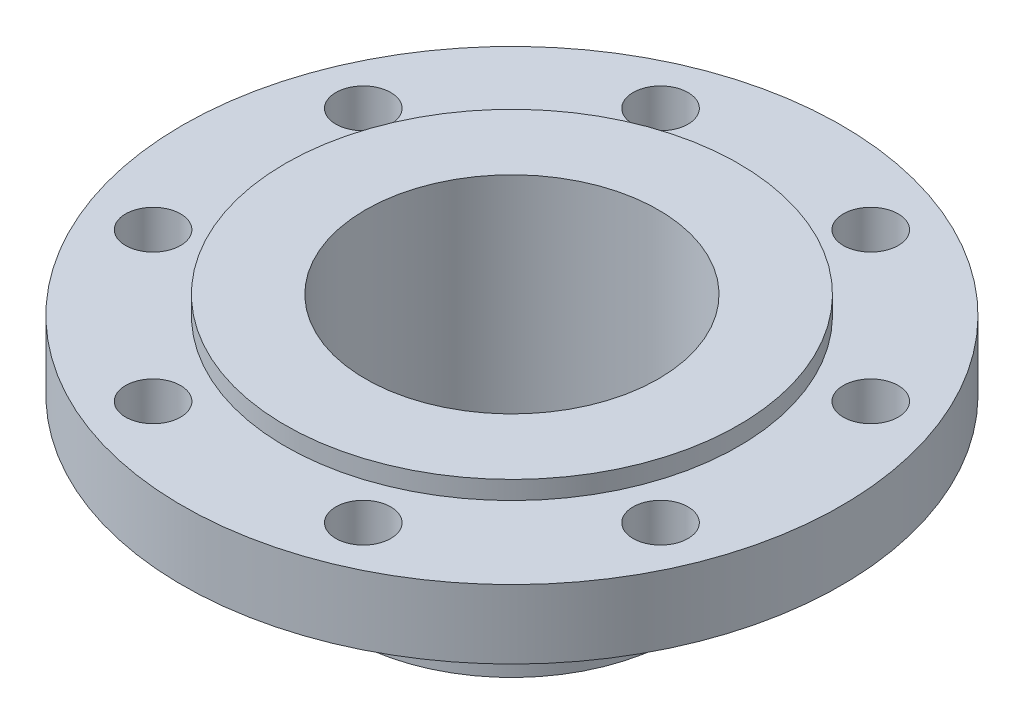
ISO-10303-21;
HEADER;
FILE_DESCRIPTION(('STEP AP214'),'2;1');
FILE_NAME('part.step','',(''),(''),'','','');
FILE_SCHEMA(('AUTOMOTIVE_DESIGN { 1 0 10303 214 1 1 1 1 }'));
ENDSEC;
DATA;
#1=APPLICATION_CONTEXT('core data for automotive mechanical design processes');
#2=APPLICATION_PROTOCOL_DEFINITION('international standard','automotive_design',2000,#1);
#3=PRODUCT_CONTEXT('',#1,'mechanical');
#4=PRODUCT('Part','Part','',(#3));
#5=PRODUCT_RELATED_PRODUCT_CATEGORY('part','',(#4));
#6=PRODUCT_DEFINITION_FORMATION('','',#4);
#7=PRODUCT_DEFINITION_CONTEXT('part definition',#1,'design');
#8=PRODUCT_DEFINITION('design','',#6,#7);
#9=PRODUCT_DEFINITION_SHAPE('','',#8);
#10=(LENGTH_UNIT() NAMED_UNIT(*) SI_UNIT(.MILLI.,.METRE.));
#11=(NAMED_UNIT(*) PLANE_ANGLE_UNIT() SI_UNIT($,.RADIAN.));
#12=(NAMED_UNIT(*) SI_UNIT($,.STERADIAN.) SOLID_ANGLE_UNIT());
#13=UNCERTAINTY_MEASURE_WITH_UNIT(LENGTH_MEASURE(1.E-05),#10,'distance_accuracy_value','');
#14=(GEOMETRIC_REPRESENTATION_CONTEXT(3) GLOBAL_UNCERTAINTY_ASSIGNED_CONTEXT((#13)) GLOBAL_UNIT_ASSIGNED_CONTEXT((#10,
#11,#12)) REPRESENTATION_CONTEXT('',''));
#15=CARTESIAN_POINT('',(0.,0.,0.));
#16=DIRECTION('',(0.,0.,1.));
#17=DIRECTION('',(1.,0.,0.));
#18=AXIS2_PLACEMENT_3D('',#15,#16,#17);
#19=CARTESIAN_POINT('',(0.,0.,0.));
#20=DIRECTION('',(0.,1.,0.));
#21=DIRECTION('',(-1.,0.,0.));
#22=AXIS2_PLACEMENT_3D('',#19,#20,#21);
#23=PLANE('',#22);
#24=CARTESIAN_POINT('',(0.,0.,0.));
#25=DIRECTION('',(0.,1.,0.));
#26=DIRECTION('',(-1.,0.,0.));
#27=AXIS2_PLACEMENT_3D('',#24,#25,#26);
#28=CIRCLE('',#27,50.8);
#29=CARTESIAN_POINT('',(-50.8,0.,0.));
#30=VERTEX_POINT('',#29);
#31=EDGE_CURVE('E49',#30,#30,#28,.T.);
#32=ORIENTED_EDGE('',*,*,#31,.F.);
#33=EDGE_LOOP('',(#32));
#34=FACE_BOUND('',#33,.T.);
#35=CARTESIAN_POINT('',(0.,0.,0.));
#36=DIRECTION('',(0.,1.,0.));
#37=DIRECTION('',(-1.,0.,0.));
#38=AXIS2_PLACEMENT_3D('',#35,#36,#37);
#39=CIRCLE('',#38,78.613);
#40=CARTESIAN_POINT('',(-78.613,0.,0.));
#41=VERTEX_POINT('',#40);
#42=EDGE_CURVE('E10',#41,#41,#39,.T.);
#43=ORIENTED_EDGE('',*,*,#42,.T.);
#44=EDGE_LOOP('',(#43));
#45=FACE_BOUND('',#44,.T.);
#46=ADVANCED_FACE('F30',(#34,#45),#23,.T.);
#47=CARTESIAN_POINT('',(0.,0.,0.));
#48=DIRECTION('',(0.,1.,0.));
#49=DIRECTION('',(-1.,0.,0.));
#50=AXIS2_PLACEMENT_3D('',#47,#48,#49);
#51=CYLINDRICAL_SURFACE('',#50,78.613);
#52=CARTESIAN_POINT('',(0.,-6.35,0.));
#53=DIRECTION('',(0.,1.,0.));
#54=DIRECTION('',(-1.,0.,0.));
#55=AXIS2_PLACEMENT_3D('',#52,#53,#54);
#56=CIRCLE('',#55,78.613);
#57=CARTESIAN_POINT('',(-78.613,-6.35000000000001,0.));
#58=VERTEX_POINT('',#57);
#59=EDGE_CURVE('E37',#58,#58,#56,.T.);
#60=ORIENTED_EDGE('',*,*,#59,.T.);
#61=EDGE_LOOP('',(#60));
#62=FACE_BOUND('',#61,.T.);
#63=ORIENTED_EDGE('',*,*,#42,.F.);
#64=EDGE_LOOP('',(#63));
#65=FACE_BOUND('',#64,.T.);
#66=ADVANCED_FACE('F114',(#62,#65),#51,.T.);
#67=CARTESIAN_POINT('',(-78.613,-6.35000000000001,0.));
#68=DIRECTION('',(0.,1.,0.));
#69=DIRECTION('',(-1.,0.,0.));
#70=AXIS2_PLACEMENT_3D('',#67,#68,#69);
#71=PLANE('',#70);
#72=CARTESIAN_POINT('',(36.4505969327737,-6.34999999999999,-87.9995254717005));
#73=DIRECTION('',(0.,1.,0.));
#74=DIRECTION('',(-0.707106781186556,0.,-0.707106781186539));
#75=AXIS2_PLACEMENT_3D('',#72,#73,#74);
#76=CIRCLE('',#75,9.525);
#77=CARTESIAN_POINT('',(29.7154048419717,-6.35,-94.7347175625023));
#78=VERTEX_POINT('',#77);
#79=EDGE_CURVE('E265',#78,#78,#76,.T.);
#80=ORIENTED_EDGE('',*,*,#79,.F.);
#81=EDGE_LOOP('',(#80));
#82=FACE_BOUND('',#81,.T.);
#83=CARTESIAN_POINT('',(87.9995254716997,-6.34999999999999,-36.4505969327758));
#84=DIRECTION('',(0.,1.,0.));
#85=DIRECTION('',(0.,0.,-1.));
#86=AXIS2_PLACEMENT_3D('',#83,#84,#85);
#87=CIRCLE('',#86,9.525);
#88=CARTESIAN_POINT('',(87.9995254716996,-6.34999999999999,-45.9755969327758));
#89=VERTEX_POINT('',#88);
#90=EDGE_CURVE('E266',#89,#89,#87,.T.);
#91=ORIENTED_EDGE('',*,*,#90,.F.);
#92=EDGE_LOOP('',(#91));
#93=FACE_BOUND('',#92,.T.);
#94=CARTESIAN_POINT('',(87.9995254717004,-6.34999999999999,36.450596932774));
#95=DIRECTION('',(0.,1.,0.));
#96=DIRECTION('',(0.707106781186541,0.,-0.707106781186554));
#97=AXIS2_PLACEMENT_3D('',#94,#95,#96);
#98=CIRCLE('',#97,9.525);
#99=CARTESIAN_POINT('',(94.7347175625022,-6.34999999999999,29.7154048419721));
#100=VERTEX_POINT('',#99);
#101=EDGE_CURVE('E268',#100,#100,#98,.T.);
#102=ORIENTED_EDGE('',*,*,#101,.F.);
#103=EDGE_LOOP('',(#102));
#104=FACE_BOUND('',#103,.T.);
#105=CARTESIAN_POINT('',(36.4505969327749,-6.35,87.9995254717));
#106=DIRECTION('',(0.,1.,0.));
#107=DIRECTION('',(1.,0.,0.));
#108=AXIS2_PLACEMENT_3D('',#105,#106,#107);
#109=CIRCLE('',#108,9.525);
#110=CARTESIAN_POINT('',(45.9755969327748,-6.34999999999999,87.9995254717));
#111=VERTEX_POINT('',#110);
#112=EDGE_CURVE('E273',#111,#111,#109,.T.);
#113=ORIENTED_EDGE('',*,*,#112,.F.);
#114=EDGE_LOOP('',(#113));
#115=FACE_BOUND('',#114,.T.);
#116=CARTESIAN_POINT('',(-36.4505969327743,-6.35,87.9995254717003));
#117=DIRECTION('',(0.,1.,0.));
#118=DIRECTION('',(0.707106781186551,0.,0.707106781186544));
#119=AXIS2_PLACEMENT_3D('',#116,#117,#118);
#120=CIRCLE('',#119,9.525);
#121=CARTESIAN_POINT('',(-29.7154048419724,-6.35,94.7347175625021));
#122=VERTEX_POINT('',#121);
#123=EDGE_CURVE('E276',#122,#122,#120,.T.);
#124=ORIENTED_EDGE('',*,*,#123,.F.);
#125=EDGE_LOOP('',(#124));
#126=FACE_BOUND('',#125,.T.);
#127=CARTESIAN_POINT('',(-87.9995254716999,-6.35000000000001,36.4505969327752));
#128=DIRECTION('',(0.,1.,0.));
#129=DIRECTION('',(0.,0.,1.));
#130=AXIS2_PLACEMENT_3D('',#127,#128,#129);
#131=CIRCLE('',#130,9.525);
#132=CARTESIAN_POINT('',(-87.9995254716999,-6.35000000000001,45.9755969327752));
#133=VERTEX_POINT('',#132);
#134=EDGE_CURVE('E279',#133,#133,#131,.T.);
#135=ORIENTED_EDGE('',*,*,#134,.F.);
#136=EDGE_LOOP('',(#135));
#137=FACE_BOUND('',#136,.T.);
#138=CARTESIAN_POINT('',(-87.9995254717002,-6.35000000000001,-36.4505969327746));
#139=DIRECTION('',(0.,1.,0.));
#140=DIRECTION('',(-0.707106781186546,0.,0.707106781186549));
#141=AXIS2_PLACEMENT_3D('',#138,#139,#140);
#142=CIRCLE('',#141,9.525);
#143=CARTESIAN_POINT('',(-94.734717562502,-6.35000000000001,-29.7154048419727));
#144=VERTEX_POINT('',#143);
#145=EDGE_CURVE('E55',#144,#144,#142,.T.);
#146=ORIENTED_EDGE('',*,*,#145,.F.);
#147=EDGE_LOOP('',(#146));
#148=FACE_BOUND('',#147,.T.);
#149=CARTESIAN_POINT('',(-36.4505969327749,-6.35,-87.9995254717));
#150=DIRECTION('',(0.,1.,0.));
#151=DIRECTION('',(-1.,0.,0.));
#152=AXIS2_PLACEMENT_3D('',#149,#150,#151);
#153=CIRCLE('',#152,9.525);
#154=CARTESIAN_POINT('',(-45.9755969327748,-6.35,-87.9995254717));
#155=VERTEX_POINT('',#154);
#156=EDGE_CURVE('E50',#155,#155,#153,.T.);
#157=ORIENTED_EDGE('',*,*,#156,.F.);
#158=EDGE_LOOP('',(#157));
#159=FACE_BOUND('',#158,.T.);
#160=CARTESIAN_POINT('',(0.,-6.35,0.));
#161=DIRECTION('',(0.,1.,0.));
#162=DIRECTION('',(-1.,0.,0.));
#163=AXIS2_PLACEMENT_3D('',#160,#161,#162);
#164=CIRCLE('',#163,114.3);
#165=CARTESIAN_POINT('',(-114.3,-6.35000000000001,0.));
#166=VERTEX_POINT('',#165);
#167=EDGE_CURVE('E42',#166,#166,#164,.T.);
#168=ORIENTED_EDGE('',*,*,#167,.T.);
#169=EDGE_LOOP('',(#168));
#170=FACE_BOUND('',#169,.T.);
#171=ORIENTED_EDGE('',*,*,#59,.F.);
#172=EDGE_LOOP('',(#171));
#173=FACE_BOUND('',#172,.T.);
#174=ADVANCED_FACE('F99',(#82,#93,#104,#115,#126,#137,#148,#159,#170,#173),#71,.T.);
#175=CARTESIAN_POINT('',(0.,0.,0.));
#176=DIRECTION('',(0.,1.,0.));
#177=DIRECTION('',(-1.,0.,0.));
#178=AXIS2_PLACEMENT_3D('',#175,#176,#177);
#179=CYLINDRICAL_SURFACE('',#178,114.3);
#180=CARTESIAN_POINT('',(0.,-30.226,0.));
#181=DIRECTION('',(0.,1.,0.));
#182=DIRECTION('',(-1.,0.,0.));
#183=AXIS2_PLACEMENT_3D('',#180,#181,#182);
#184=CIRCLE('',#183,114.3);
#185=CARTESIAN_POINT('',(-114.3,-30.226,0.));
#186=VERTEX_POINT('',#185);
#187=EDGE_CURVE('E94',#186,#186,#184,.T.);
#188=ORIENTED_EDGE('',*,*,#187,.T.);
#189=EDGE_LOOP('',(#188));
#190=FACE_BOUND('',#189,.T.);
#191=ORIENTED_EDGE('',*,*,#167,.F.);
#192=EDGE_LOOP('',(#191));
#193=FACE_BOUND('',#192,.T.);
#194=ADVANCED_FACE('F102',(#190,#193),#179,.T.);
#195=CARTESIAN_POINT('',(-114.3,-30.226,0.));
#196=DIRECTION('',(0.,-1.,0.));
#197=DIRECTION('',(1.,0.,0.));
#198=AXIS2_PLACEMENT_3D('',#195,#196,#197);
#199=PLANE('',#198);
#200=CARTESIAN_POINT('',(36.4505969327737,-30.226,-87.9995254717005));
#201=DIRECTION('',(0.,-1.,0.));
#202=DIRECTION('',(1.,0.,0.));
#203=AXIS2_PLACEMENT_3D('',#200,#201,#202);
#204=CIRCLE('',#203,9.525);
#205=CARTESIAN_POINT('',(45.9755969327737,-30.226,-87.9995254717005));
#206=VERTEX_POINT('',#205);
#207=EDGE_CURVE('E33',#206,#206,#204,.T.);
#208=ORIENTED_EDGE('',*,*,#207,.F.);
#209=EDGE_LOOP('',(#208));
#210=FACE_BOUND('',#209,.T.);
#211=CARTESIAN_POINT('',(87.9995254716997,-30.226,-36.4505969327758));
#212=DIRECTION('',(0.,-1.,0.));
#213=DIRECTION('',(1.,0.,0.));
#214=AXIS2_PLACEMENT_3D('',#211,#212,#213);
#215=CIRCLE('',#214,9.525);
#216=CARTESIAN_POINT('',(97.5245254716997,-30.226,-36.4505969327758));
#217=VERTEX_POINT('',#216);
#218=EDGE_CURVE('E66',#217,#217,#215,.T.);
#219=ORIENTED_EDGE('',*,*,#218,.F.);
#220=EDGE_LOOP('',(#219));
#221=FACE_BOUND('',#220,.T.);
#222=CARTESIAN_POINT('',(87.9995254717004,-30.226,36.450596932774));
#223=DIRECTION('',(0.,-1.,0.));
#224=DIRECTION('',(1.,0.,0.));
#225=AXIS2_PLACEMENT_3D('',#222,#223,#224);
#226=CIRCLE('',#225,9.525);
#227=CARTESIAN_POINT('',(97.5245254717004,-30.226,36.450596932774));
#228=VERTEX_POINT('',#227);
#229=EDGE_CURVE('E64',#228,#228,#226,.T.);
#230=ORIENTED_EDGE('',*,*,#229,.F.);
#231=EDGE_LOOP('',(#230));
#232=FACE_BOUND('',#231,.T.);
#233=CARTESIAN_POINT('',(36.4505969327749,-30.226,87.9995254717));
#234=DIRECTION('',(0.,-1.,0.));
#235=DIRECTION('',(1.,0.,0.));
#236=AXIS2_PLACEMENT_3D('',#233,#234,#235);
#237=CIRCLE('',#236,9.525);
#238=CARTESIAN_POINT('',(45.9755969327748,-30.226,87.9995254717));
#239=VERTEX_POINT('',#238);
#240=EDGE_CURVE('E61',#239,#239,#237,.T.);
#241=ORIENTED_EDGE('',*,*,#240,.F.);
#242=EDGE_LOOP('',(#241));
#243=FACE_BOUND('',#242,.T.);
#244=CARTESIAN_POINT('',(-36.4505969327743,-30.226,87.9995254717003));
#245=DIRECTION('',(0.,-1.,0.));
#246=DIRECTION('',(1.,0.,0.));
#247=AXIS2_PLACEMENT_3D('',#244,#245,#246);
#248=CIRCLE('',#247,9.525);
#249=CARTESIAN_POINT('',(-26.9255969327743,-30.226,87.9995254717003));
#250=VERTEX_POINT('',#249);
#251=EDGE_CURVE('E58',#250,#250,#248,.T.);
#252=ORIENTED_EDGE('',*,*,#251,.F.);
#253=EDGE_LOOP('',(#252));
#254=FACE_BOUND('',#253,.T.);
#255=CARTESIAN_POINT('',(-87.9995254716999,-30.226,36.4505969327752));
#256=DIRECTION('',(0.,-1.,0.));
#257=DIRECTION('',(1.,0.,0.));
#258=AXIS2_PLACEMENT_3D('',#255,#256,#257);
#259=CIRCLE('',#258,9.525);
#260=CARTESIAN_POINT('',(-78.4745254716999,-30.226,36.4505969327752));
#261=VERTEX_POINT('',#260);
#262=EDGE_CURVE('E54',#261,#261,#259,.T.);
#263=ORIENTED_EDGE('',*,*,#262,.F.);
#264=EDGE_LOOP('',(#263));
#265=FACE_BOUND('',#264,.T.);
#266=CARTESIAN_POINT('',(-87.9995254717001,-30.226,-36.4505969327746));
#267=DIRECTION('',(0.,-1.,0.));
#268=DIRECTION('',(1.,0.,0.));
#269=AXIS2_PLACEMENT_3D('',#266,#267,#268);
#270=CIRCLE('',#269,9.525);
#271=CARTESIAN_POINT('',(-78.4745254717001,-30.226,-36.4505969327746));
#272=VERTEX_POINT('',#271);
#273=EDGE_CURVE('E51',#272,#272,#270,.T.);
#274=ORIENTED_EDGE('',*,*,#273,.F.);
#275=EDGE_LOOP('',(#274));
#276=FACE_BOUND('',#275,.T.);
#277=CARTESIAN_POINT('',(-36.4505969327749,-30.226,-87.9995254717));
#278=DIRECTION('',(0.,-1.,0.));
#279=DIRECTION('',(1.,0.,0.));
#280=AXIS2_PLACEMENT_3D('',#277,#278,#279);
#281=CIRCLE('',#280,9.525);
#282=CARTESIAN_POINT('',(-26.9255969327749,-30.226,-87.9995254717));
#283=VERTEX_POINT('',#282);
#284=EDGE_CURVE('E46',#283,#283,#281,.T.);
#285=ORIENTED_EDGE('',*,*,#284,.F.);
#286=EDGE_LOOP('',(#285));
#287=FACE_BOUND('',#286,.T.);
#288=CARTESIAN_POINT('',(0.,-30.226,0.));
#289=DIRECTION('',(0.,1.,0.));
#290=DIRECTION('',(-1.,0.,0.));
#291=AXIS2_PLACEMENT_3D('',#288,#289,#290);
#292=CIRCLE('',#291,67.437);
#293=CARTESIAN_POINT('',(-67.437,-30.226,0.));
#294=VERTEX_POINT('',#293);
#295=EDGE_CURVE('E91',#294,#294,#292,.T.);
#296=ORIENTED_EDGE('',*,*,#295,.T.);
#297=EDGE_LOOP('',(#296));
#298=FACE_BOUND('',#297,.T.);
#299=ORIENTED_EDGE('',*,*,#187,.F.);
#300=EDGE_LOOP('',(#299));
#301=FACE_BOUND('',#300,.T.);
#302=ADVANCED_FACE('F104',(#210,#221,#232,#243,#254,#265,#276,#287,#298,#301),#199,.T.);
#303=CARTESIAN_POINT('',(0.,-30.226,0.));
#304=DIRECTION('',(0.,1.,0.));
#305=DIRECTION('',(-1.,0.,0.));
#306=AXIS2_PLACEMENT_3D('',#303,#304,#305);
#307=CONICAL_SURFACE('',#306,67.437,0.277216738636352);
#308=CARTESIAN_POINT('',(0.,-66.3786666666667,0.));
#309=DIRECTION('',(0.,1.,0.));
#310=DIRECTION('',(-1.,0.,0.));
#311=AXIS2_PLACEMENT_3D('',#308,#309,#310);
#312=CIRCLE('',#311,57.15);
#313=CARTESIAN_POINT('',(-57.15,-66.3786666666667,0.));
#314=VERTEX_POINT('',#313);
#315=EDGE_CURVE('E88',#314,#314,#312,.T.);
#316=ORIENTED_EDGE('',*,*,#315,.T.);
#317=EDGE_LOOP('',(#316));
#318=FACE_BOUND('',#317,.T.);
#319=ORIENTED_EDGE('',*,*,#295,.F.);
#320=EDGE_LOOP('',(#319));
#321=FACE_BOUND('',#320,.T.);
#322=ADVANCED_FACE('F111',(#318,#321),#307,.T.);
#323=CARTESIAN_POINT('',(0.,0.,0.));
#324=DIRECTION('',(0.,1.,0.));
#325=DIRECTION('',(-1.,0.,0.));
#326=AXIS2_PLACEMENT_3D('',#323,#324,#325);
#327=CYLINDRICAL_SURFACE('',#326,57.15);
#328=CARTESIAN_POINT('',(0.,-74.676,0.));
#329=DIRECTION('',(0.,1.,0.));
#330=DIRECTION('',(-1.,0.,0.));
#331=AXIS2_PLACEMENT_3D('',#328,#329,#330);
#332=CIRCLE('',#331,57.15);
#333=CARTESIAN_POINT('',(-57.15,-74.676,0.));
#334=VERTEX_POINT('',#333);
#335=EDGE_CURVE('E83',#334,#334,#332,.T.);
#336=ORIENTED_EDGE('',*,*,#335,.T.);
#337=EDGE_LOOP('',(#336));
#338=FACE_BOUND('',#337,.T.);
#339=ORIENTED_EDGE('',*,*,#315,.F.);
#340=EDGE_LOOP('',(#339));
#341=FACE_BOUND('',#340,.T.);
#342=ADVANCED_FACE('F138',(#338,#341),#327,.T.);
#343=CARTESIAN_POINT('',(-57.15,-74.676,0.));
#344=DIRECTION('',(0.,-1.,0.));
#345=DIRECTION('',(1.,0.,0.));
#346=AXIS2_PLACEMENT_3D('',#343,#344,#345);
#347=PLANE('',#346);
#348=CARTESIAN_POINT('',(0.,-74.676,0.));
#349=DIRECTION('',(0.,1.,0.));
#350=DIRECTION('',(-1.,0.,0.));
#351=AXIS2_PLACEMENT_3D('',#348,#349,#350);
#352=CIRCLE('',#351,50.8);
#353=CARTESIAN_POINT('',(-50.8,-74.676,0.));
#354=VERTEX_POINT('',#353);
#355=EDGE_CURVE('E80',#354,#354,#352,.T.);
#356=ORIENTED_EDGE('',*,*,#355,.T.);
#357=EDGE_LOOP('',(#356));
#358=FACE_BOUND('',#357,.T.);
#359=ORIENTED_EDGE('',*,*,#335,.F.);
#360=EDGE_LOOP('',(#359));
#361=FACE_BOUND('',#360,.T.);
#362=ADVANCED_FACE('F128',(#358,#361),#347,.T.);
#363=CARTESIAN_POINT('',(0.,-74.676,0.));
#364=DIRECTION('',(0.,1.,0.));
#365=DIRECTION('',(-1.,0.,0.));
#366=AXIS2_PLACEMENT_3D('',#363,#364,#365);
#367=CYLINDRICAL_SURFACE('',#366,50.8);
#368=ORIENTED_EDGE('',*,*,#355,.F.);
#369=EDGE_LOOP('',(#368));
#370=FACE_BOUND('',#369,.T.);
#371=ORIENTED_EDGE('',*,*,#31,.T.);
#372=EDGE_LOOP('',(#371));
#373=FACE_BOUND('',#372,.T.);
#374=ADVANCED_FACE('F125',(#370,#373),#367,.F.);
#375=CARTESIAN_POINT('',(-36.4505969327748,-74.676,-87.9995254717));
#376=DIRECTION('',(0.,1.,0.));
#377=DIRECTION('',(-1.,0.,0.));
#378=AXIS2_PLACEMENT_3D('',#375,#376,#377);
#379=CYLINDRICAL_SURFACE('',#378,9.525);
#380=ORIENTED_EDGE('',*,*,#284,.T.);
#381=EDGE_LOOP('',(#380));
#382=FACE_BOUND('',#381,.T.);
#383=ORIENTED_EDGE('',*,*,#156,.T.);
#384=EDGE_LOOP('',(#383));
#385=FACE_BOUND('',#384,.T.);
#386=ADVANCED_FACE('F127',(#382,#385),#379,.F.);
#387=CARTESIAN_POINT('',(-87.9995254717001,-74.676,-36.4505969327746));
#388=DIRECTION('',(0.,1.,0.));
#389=DIRECTION('',(-1.,0.,0.));
#390=AXIS2_PLACEMENT_3D('',#387,#388,#389);
#391=CYLINDRICAL_SURFACE('',#390,9.525);
#392=ORIENTED_EDGE('',*,*,#273,.T.);
#393=EDGE_LOOP('',(#392));
#394=FACE_BOUND('',#393,.T.);
#395=ORIENTED_EDGE('',*,*,#145,.T.);
#396=EDGE_LOOP('',(#395));
#397=FACE_BOUND('',#396,.T.);
#398=ADVANCED_FACE('F135',(#394,#397),#391,.F.);
#399=CARTESIAN_POINT('',(-87.9995254716999,-74.676,36.4505969327752));
#400=DIRECTION('',(0.,1.,0.));
#401=DIRECTION('',(-1.,0.,0.));
#402=AXIS2_PLACEMENT_3D('',#399,#400,#401);
#403=CYLINDRICAL_SURFACE('',#402,9.525);
#404=ORIENTED_EDGE('',*,*,#262,.T.);
#405=EDGE_LOOP('',(#404));
#406=FACE_BOUND('',#405,.T.);
#407=ORIENTED_EDGE('',*,*,#134,.T.);
#408=EDGE_LOOP('',(#407));
#409=FACE_BOUND('',#408,.T.);
#410=ADVANCED_FACE('F201',(#406,#409),#403,.F.);
#411=CARTESIAN_POINT('',(-36.4505969327743,-74.676,87.9995254717003));
#412=DIRECTION('',(0.,1.,0.));
#413=DIRECTION('',(-1.,0.,0.));
#414=AXIS2_PLACEMENT_3D('',#411,#412,#413);
#415=CYLINDRICAL_SURFACE('',#414,9.525);
#416=ORIENTED_EDGE('',*,*,#251,.T.);
#417=EDGE_LOOP('',(#416));
#418=FACE_BOUND('',#417,.T.);
#419=ORIENTED_EDGE('',*,*,#123,.T.);
#420=EDGE_LOOP('',(#419));
#421=FACE_BOUND('',#420,.T.);
#422=ADVANCED_FACE('F210',(#418,#421),#415,.F.);
#423=CARTESIAN_POINT('',(36.4505969327749,-74.676,87.9995254717));
#424=DIRECTION('',(0.,1.,0.));
#425=DIRECTION('',(-1.,0.,0.));
#426=AXIS2_PLACEMENT_3D('',#423,#424,#425);
#427=CYLINDRICAL_SURFACE('',#426,9.525);
#428=ORIENTED_EDGE('',*,*,#240,.T.);
#429=EDGE_LOOP('',(#428));
#430=FACE_BOUND('',#429,.T.);
#431=ORIENTED_EDGE('',*,*,#112,.T.);
#432=EDGE_LOOP('',(#431));
#433=FACE_BOUND('',#432,.T.);
#434=ADVANCED_FACE('F220',(#430,#433),#427,.F.);
#435=CARTESIAN_POINT('',(87.9995254717004,-74.676,36.450596932774));
#436=DIRECTION('',(0.,1.,0.));
#437=DIRECTION('',(-1.,0.,0.));
#438=AXIS2_PLACEMENT_3D('',#435,#436,#437);
#439=CYLINDRICAL_SURFACE('',#438,9.525);
#440=ORIENTED_EDGE('',*,*,#229,.T.);
#441=EDGE_LOOP('',(#440));
#442=FACE_BOUND('',#441,.T.);
#443=ORIENTED_EDGE('',*,*,#101,.T.);
#444=EDGE_LOOP('',(#443));
#445=FACE_BOUND('',#444,.T.);
#446=ADVANCED_FACE('F230',(#442,#445),#439,.F.);
#447=CARTESIAN_POINT('',(87.9995254716997,-74.676,-36.4505969327758));
#448=DIRECTION('',(0.,1.,0.));
#449=DIRECTION('',(-1.,0.,0.));
#450=AXIS2_PLACEMENT_3D('',#447,#448,#449);
#451=CYLINDRICAL_SURFACE('',#450,9.525);
#452=ORIENTED_EDGE('',*,*,#218,.T.);
#453=EDGE_LOOP('',(#452));
#454=FACE_BOUND('',#453,.T.);
#455=ORIENTED_EDGE('',*,*,#90,.T.);
#456=EDGE_LOOP('',(#455));
#457=FACE_BOUND('',#456,.T.);
#458=ADVANCED_FACE('F240',(#454,#457),#451,.F.);
#459=CARTESIAN_POINT('',(36.4505969327737,-74.676,-87.9995254717005));
#460=DIRECTION('',(0.,1.,0.));
#461=DIRECTION('',(-1.,0.,0.));
#462=AXIS2_PLACEMENT_3D('',#459,#460,#461);
#463=CYLINDRICAL_SURFACE('',#462,9.525);
#464=ORIENTED_EDGE('',*,*,#207,.T.);
#465=EDGE_LOOP('',(#464));
#466=FACE_BOUND('',#465,.T.);
#467=ORIENTED_EDGE('',*,*,#79,.T.);
#468=EDGE_LOOP('',(#467));
#469=FACE_BOUND('',#468,.T.);
#470=ADVANCED_FACE('F250',(#466,#469),#463,.F.);
#471=CLOSED_SHELL('',(#46,#66,#174,#194,#302,#322,#342,#362,#374,#386,#398,#410,#422,#434,#446,
#458,#470));
#472=MANIFOLD_SOLID_BREP('B2',#471);
#473=ADVANCED_BREP_SHAPE_REPRESENTATION('',(#18,#472),#14);
#474=SHAPE_DEFINITION_REPRESENTATION(#9,#473);
ENDSEC;
END-ISO-10303-21;
